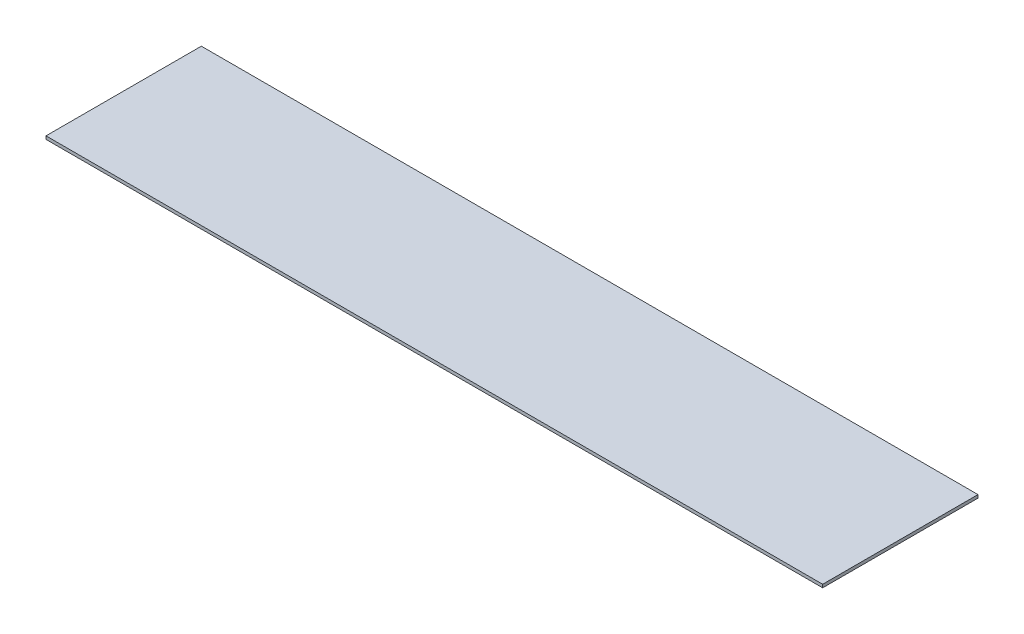
ISO-10303-21;
HEADER;
FILE_DESCRIPTION(('STEP AP214'),'2;1');
FILE_NAME('part.step','',(''),(''),'','','');
FILE_SCHEMA(('AUTOMOTIVE_DESIGN { 1 0 10303 214 1 1 1 1 }'));
ENDSEC;
DATA;
#1=APPLICATION_CONTEXT('core data for automotive mechanical design processes');
#2=APPLICATION_PROTOCOL_DEFINITION('international standard','automotive_design',2000,#1);
#3=PRODUCT_CONTEXT('',#1,'mechanical');
#4=PRODUCT('Part','Part','',(#3));
#5=PRODUCT_RELATED_PRODUCT_CATEGORY('part','',(#4));
#6=PRODUCT_DEFINITION_FORMATION('','',#4);
#7=PRODUCT_DEFINITION_CONTEXT('part definition',#1,'design');
#8=PRODUCT_DEFINITION('design','',#6,#7);
#9=PRODUCT_DEFINITION_SHAPE('','',#8);
#10=(LENGTH_UNIT() NAMED_UNIT(*) SI_UNIT(.MILLI.,.METRE.));
#11=(NAMED_UNIT(*) PLANE_ANGLE_UNIT() SI_UNIT($,.RADIAN.));
#12=(NAMED_UNIT(*) SI_UNIT($,.STERADIAN.) SOLID_ANGLE_UNIT());
#13=UNCERTAINTY_MEASURE_WITH_UNIT(LENGTH_MEASURE(1.E-05),#10,'distance_accuracy_value','');
#14=(GEOMETRIC_REPRESENTATION_CONTEXT(3) GLOBAL_UNCERTAINTY_ASSIGNED_CONTEXT((#13)) GLOBAL_UNIT_ASSIGNED_CONTEXT((#10,
#11,#12)) REPRESENTATION_CONTEXT('',''));
#15=CARTESIAN_POINT('',(0.,0.,0.));
#16=DIRECTION('',(0.,0.,1.));
#17=DIRECTION('',(1.,0.,0.));
#18=AXIS2_PLACEMENT_3D('',#15,#16,#17);
#19=CARTESIAN_POINT('',(50.,0.4,-10.));
#20=DIRECTION('',(-1.,0.,0.));
#21=DIRECTION('',(0.,0.,1.));
#22=AXIS2_PLACEMENT_3D('',#19,#20,#21);
#23=PLANE('',#22);
#24=DIRECTION('',(0.,0.,-1.));
#25=VECTOR('',#24,1.);
#26=CARTESIAN_POINT('',(50.,0.,-10.));
#27=LINE('',#26,#25);
#28=CARTESIAN_POINT('',(50.,0.,10.));
#29=VERTEX_POINT('',#28);
#30=CARTESIAN_POINT('',(50.,0.,-10.));
#31=VERTEX_POINT('',#30);
#32=EDGE_CURVE('E113',#29,#31,#27,.T.);
#33=ORIENTED_EDGE('',*,*,#32,.T.);
#34=DIRECTION('',(0.,-1.,0.));
#35=VECTOR('',#34,1.);
#36=CARTESIAN_POINT('',(50.,0.4,-10.));
#37=LINE('',#36,#35);
#38=CARTESIAN_POINT('',(50.,0.4,-10.));
#39=VERTEX_POINT('',#38);
#40=EDGE_CURVE('E11',#39,#31,#37,.T.);
#41=ORIENTED_EDGE('',*,*,#40,.F.);
#42=DIRECTION('',(0.,0.,-1.));
#43=VECTOR('',#42,1.);
#44=CARTESIAN_POINT('',(50.,0.4,-10.));
#45=LINE('',#44,#43);
#46=CARTESIAN_POINT('',(50.,0.4,10.));
#47=VERTEX_POINT('',#46);
#48=EDGE_CURVE('E97',#47,#39,#45,.T.);
#49=ORIENTED_EDGE('',*,*,#48,.F.);
#50=DIRECTION('',(0.,-1.,0.));
#51=VECTOR('',#50,1.);
#52=CARTESIAN_POINT('',(50.,0.4,10.));
#53=LINE('',#52,#51);
#54=EDGE_CURVE('E109',#47,#29,#53,.T.);
#55=ORIENTED_EDGE('',*,*,#54,.T.);
#56=EDGE_LOOP('',(#33,#41,#49,#55));
#57=FACE_BOUND('',#56,.T.);
#58=ADVANCED_FACE('F45',(#57),#23,.F.);
#59=CARTESIAN_POINT('',(-50.,0.4,-10.));
#60=DIRECTION('',(0.,0.,1.));
#61=DIRECTION('',(1.,0.,0.));
#62=AXIS2_PLACEMENT_3D('',#59,#60,#61);
#63=PLANE('',#62);
#64=DIRECTION('',(-1.,0.,0.));
#65=VECTOR('',#64,1.);
#66=CARTESIAN_POINT('',(-50.,0.,-10.));
#67=LINE('',#66,#65);
#68=CARTESIAN_POINT('',(-50.,0.,-10.));
#69=VERTEX_POINT('',#68);
#70=EDGE_CURVE('E102',#31,#69,#67,.T.);
#71=ORIENTED_EDGE('',*,*,#70,.T.);
#72=DIRECTION('',(0.,-1.,0.));
#73=VECTOR('',#72,1.);
#74=CARTESIAN_POINT('',(-50.,0.4,-10.));
#75=LINE('',#74,#73);
#76=CARTESIAN_POINT('',(-50.,0.4,-10.));
#77=VERTEX_POINT('',#76);
#78=EDGE_CURVE('E54',#77,#69,#75,.T.);
#79=ORIENTED_EDGE('',*,*,#78,.F.);
#80=DIRECTION('',(-1.,0.,0.));
#81=VECTOR('',#80,1.);
#82=CARTESIAN_POINT('',(-50.,0.4,-10.));
#83=LINE('',#82,#81);
#84=EDGE_CURVE('E92',#39,#77,#83,.T.);
#85=ORIENTED_EDGE('',*,*,#84,.F.);
#86=ORIENTED_EDGE('',*,*,#40,.T.);
#87=EDGE_LOOP('',(#71,#79,#85,#86));
#88=FACE_BOUND('',#87,.T.);
#89=ADVANCED_FACE('F101',(#88),#63,.F.);
#90=CARTESIAN_POINT('',(-50.,0.4,-10.));
#91=DIRECTION('',(1.,0.,0.));
#92=DIRECTION('',(0.,0.,-1.));
#93=AXIS2_PLACEMENT_3D('',#90,#91,#92);
#94=PLANE('',#93);
#95=DIRECTION('',(0.,0.,1.));
#96=VECTOR('',#95,1.);
#97=CARTESIAN_POINT('',(-50.,0.,-10.));
#98=LINE('',#97,#96);
#99=CARTESIAN_POINT('',(-50.,0.,10.));
#100=VERTEX_POINT('',#99);
#101=EDGE_CURVE('E79',#69,#100,#98,.T.);
#102=ORIENTED_EDGE('',*,*,#101,.T.);
#103=DIRECTION('',(0.,-1.,0.));
#104=VECTOR('',#103,1.);
#105=CARTESIAN_POINT('',(-50.,0.4,10.));
#106=LINE('',#105,#104);
#107=CARTESIAN_POINT('',(-50.,0.4,10.));
#108=VERTEX_POINT('',#107);
#109=EDGE_CURVE('E104',#108,#100,#106,.T.);
#110=ORIENTED_EDGE('',*,*,#109,.F.);
#111=DIRECTION('',(0.,0.,1.));
#112=VECTOR('',#111,1.);
#113=CARTESIAN_POINT('',(-50.,0.4,-10.));
#114=LINE('',#113,#112);
#115=EDGE_CURVE('E95',#77,#108,#114,.T.);
#116=ORIENTED_EDGE('',*,*,#115,.F.);
#117=ORIENTED_EDGE('',*,*,#78,.T.);
#118=EDGE_LOOP('',(#102,#110,#116,#117));
#119=FACE_BOUND('',#118,.T.);
#120=ADVANCED_FACE('F105',(#119),#94,.F.);
#121=CARTESIAN_POINT('',(-50.,0.4,10.));
#122=DIRECTION('',(0.,0.,-1.));
#123=DIRECTION('',(-1.,0.,0.));
#124=AXIS2_PLACEMENT_3D('',#121,#122,#123);
#125=PLANE('',#124);
#126=DIRECTION('',(1.,0.,0.));
#127=VECTOR('',#126,1.);
#128=CARTESIAN_POINT('',(-50.,0.,10.));
#129=LINE('',#128,#127);
#130=EDGE_CURVE('E85',#100,#29,#129,.T.);
#131=ORIENTED_EDGE('',*,*,#130,.T.);
#132=ORIENTED_EDGE('',*,*,#54,.F.);
#133=DIRECTION('',(1.,0.,0.));
#134=VECTOR('',#133,1.);
#135=CARTESIAN_POINT('',(-50.,0.4,10.));
#136=LINE('',#135,#134);
#137=EDGE_CURVE('E62',#108,#47,#136,.T.);
#138=ORIENTED_EDGE('',*,*,#137,.F.);
#139=ORIENTED_EDGE('',*,*,#109,.T.);
#140=EDGE_LOOP('',(#131,#132,#138,#139));
#141=FACE_BOUND('',#140,.T.);
#142=ADVANCED_FACE('F126',(#141),#125,.F.);
#143=CARTESIAN_POINT('',(0.,0.4,0.));
#144=DIRECTION('',(0.,1.,0.));
#145=DIRECTION('',(0.,0.,1.));
#146=AXIS2_PLACEMENT_3D('',#143,#144,#145);
#147=PLANE('',#146);
#148=ORIENTED_EDGE('',*,*,#48,.T.);
#149=ORIENTED_EDGE('',*,*,#84,.T.);
#150=ORIENTED_EDGE('',*,*,#115,.T.);
#151=ORIENTED_EDGE('',*,*,#137,.T.);
#152=EDGE_LOOP('',(#148,#149,#150,#151));
#153=FACE_BOUND('',#152,.T.);
#154=ADVANCED_FACE('F93',(#153),#147,.T.);
#155=CARTESIAN_POINT('',(0.,0.,0.));
#156=DIRECTION('',(0.,1.,0.));
#157=DIRECTION('',(0.,0.,1.));
#158=AXIS2_PLACEMENT_3D('',#155,#156,#157);
#159=PLANE('',#158);
#160=ORIENTED_EDGE('',*,*,#32,.F.);
#161=ORIENTED_EDGE('',*,*,#130,.F.);
#162=ORIENTED_EDGE('',*,*,#101,.F.);
#163=ORIENTED_EDGE('',*,*,#70,.F.);
#164=EDGE_LOOP('',(#160,#161,#162,#163));
#165=FACE_BOUND('',#164,.T.);
#166=ADVANCED_FACE('F129',(#165),#159,.F.);
#167=CLOSED_SHELL('',(#58,#89,#120,#142,#154,#166));
#168=MANIFOLD_SOLID_BREP('B2',#167);
#169=ADVANCED_BREP_SHAPE_REPRESENTATION('',(#18,#168),#14);
#170=SHAPE_DEFINITION_REPRESENTATION(#9,#169);
ENDSEC;
END-ISO-10303-21;
